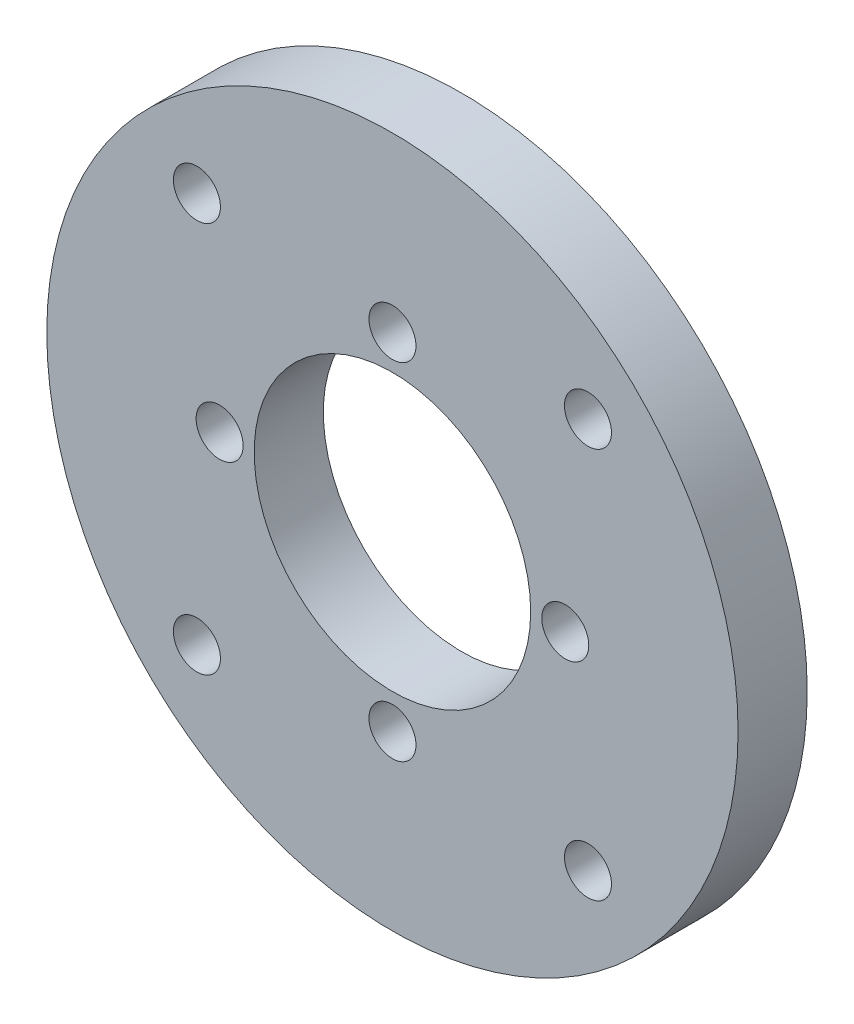
ISO-10303-21;
HEADER;
FILE_DESCRIPTION(('STEP AP214'),'2;1');
FILE_NAME('part.step','',(''),(''),'','','');
FILE_SCHEMA(('AUTOMOTIVE_DESIGN { 1 0 10303 214 1 1 1 1 }'));
ENDSEC;
DATA;
#1=APPLICATION_CONTEXT('core data for automotive mechanical design processes');
#2=APPLICATION_PROTOCOL_DEFINITION('international standard','automotive_design',2000,#1);
#3=PRODUCT_CONTEXT('',#1,'mechanical');
#4=PRODUCT('Part','Part','',(#3));
#5=PRODUCT_RELATED_PRODUCT_CATEGORY('part','',(#4));
#6=PRODUCT_DEFINITION_FORMATION('','',#4);
#7=PRODUCT_DEFINITION_CONTEXT('part definition',#1,'design');
#8=PRODUCT_DEFINITION('design','',#6,#7);
#9=PRODUCT_DEFINITION_SHAPE('','',#8);
#10=(LENGTH_UNIT() NAMED_UNIT(*) SI_UNIT(.MILLI.,.METRE.));
#11=(NAMED_UNIT(*) PLANE_ANGLE_UNIT() SI_UNIT($,.RADIAN.));
#12=(NAMED_UNIT(*) SI_UNIT($,.STERADIAN.) SOLID_ANGLE_UNIT());
#13=UNCERTAINTY_MEASURE_WITH_UNIT(LENGTH_MEASURE(1.E-05),#10,'distance_accuracy_value','');
#14=(GEOMETRIC_REPRESENTATION_CONTEXT(3) GLOBAL_UNCERTAINTY_ASSIGNED_CONTEXT((#13)) GLOBAL_UNIT_ASSIGNED_CONTEXT((#10,
#11,#12)) REPRESENTATION_CONTEXT('',''));
#15=CARTESIAN_POINT('',(0.,0.,0.));
#16=DIRECTION('',(0.,0.,1.));
#17=DIRECTION('',(1.,0.,0.));
#18=AXIS2_PLACEMENT_3D('',#15,#16,#17);
#19=CARTESIAN_POINT('',(0.,0.,5.));
#20=DIRECTION('',(0.,0.,1.));
#21=DIRECTION('',(1.,0.,0.));
#22=AXIS2_PLACEMENT_3D('',#19,#20,#21);
#23=PLANE('',#22);
#24=CARTESIAN_POINT('',(14.1421356237311,-14.1421356237308,5.));
#25=DIRECTION('',(0.,0.,1.));
#26=DIRECTION('',(1.,0.,0.));
#27=AXIS2_PLACEMENT_3D('',#24,#25,#26);
#28=CIRCLE('',#27,1.69999999999999);
#29=CARTESIAN_POINT('',(15.8421356237311,-14.1421356237308,5.));
#30=VERTEX_POINT('',#29);
#31=EDGE_CURVE('E69',#30,#30,#28,.T.);
#32=ORIENTED_EDGE('',*,*,#31,.F.);
#33=EDGE_LOOP('',(#32));
#34=FACE_BOUND('',#33,.T.);
#35=CARTESIAN_POINT('',(-14.1421356237309,-14.142135623731,5.));
#36=DIRECTION('',(0.,0.,1.));
#37=DIRECTION('',(1.,0.,0.));
#38=AXIS2_PLACEMENT_3D('',#35,#36,#37);
#39=CIRCLE('',#38,1.69999999999999);
#40=CARTESIAN_POINT('',(-12.4421356237309,-14.142135623731,5.));
#41=VERTEX_POINT('',#40);
#42=EDGE_CURVE('E58',#41,#41,#39,.T.);
#43=ORIENTED_EDGE('',*,*,#42,.F.);
#44=EDGE_LOOP('',(#43));
#45=FACE_BOUND('',#44,.T.);
#46=CARTESIAN_POINT('',(-14.142135623731,14.1421356237309,5.));
#47=DIRECTION('',(0.,0.,1.));
#48=DIRECTION('',(1.,0.,0.));
#49=AXIS2_PLACEMENT_3D('',#46,#47,#48);
#50=CIRCLE('',#49,1.69999999999999);
#51=CARTESIAN_POINT('',(-12.442135623731,14.1421356237309,5.));
#52=VERTEX_POINT('',#51);
#53=EDGE_CURVE('E57',#52,#52,#50,.T.);
#54=ORIENTED_EDGE('',*,*,#53,.F.);
#55=EDGE_LOOP('',(#54));
#56=FACE_BOUND('',#55,.T.);
#57=CARTESIAN_POINT('',(14.1421356237309,14.142135623731,5.));
#58=DIRECTION('',(0.,0.,1.));
#59=DIRECTION('',(1.,0.,0.));
#60=AXIS2_PLACEMENT_3D('',#57,#58,#59);
#61=CIRCLE('',#60,1.69999999999999);
#62=CARTESIAN_POINT('',(15.8421356237309,14.142135623731,5.));
#63=VERTEX_POINT('',#62);
#64=EDGE_CURVE('E54',#63,#63,#61,.T.);
#65=ORIENTED_EDGE('',*,*,#64,.F.);
#66=EDGE_LOOP('',(#65));
#67=FACE_BOUND('',#66,.T.);
#68=CARTESIAN_POINT('',(12.5,1.30930550206618E-13,5.));
#69=DIRECTION('',(0.,0.,1.));
#70=DIRECTION('',(1.,0.,0.));
#71=AXIS2_PLACEMENT_3D('',#68,#69,#70);
#72=CIRCLE('',#71,1.7);
#73=CARTESIAN_POINT('',(14.2,1.30930550206618E-13,5.));
#74=VERTEX_POINT('',#73);
#75=EDGE_CURVE('E53',#74,#74,#72,.T.);
#76=ORIENTED_EDGE('',*,*,#75,.F.);
#77=EDGE_LOOP('',(#76));
#78=FACE_BOUND('',#77,.T.);
#79=CARTESIAN_POINT('',(0.,-12.5,5.));
#80=DIRECTION('',(0.,0.,1.));
#81=DIRECTION('',(1.,0.,0.));
#82=AXIS2_PLACEMENT_3D('',#79,#80,#81);
#83=CIRCLE('',#82,1.7);
#84=CARTESIAN_POINT('',(1.7,-12.5,5.));
#85=VERTEX_POINT('',#84);
#86=EDGE_CURVE('E81',#85,#85,#83,.T.);
#87=ORIENTED_EDGE('',*,*,#86,.F.);
#88=EDGE_LOOP('',(#87));
#89=FACE_BOUND('',#88,.T.);
#90=CARTESIAN_POINT('',(-12.5,0.,5.));
#91=DIRECTION('',(0.,0.,1.));
#92=DIRECTION('',(1.,0.,0.));
#93=AXIS2_PLACEMENT_3D('',#90,#91,#92);
#94=CIRCLE('',#93,1.7);
#95=CARTESIAN_POINT('',(-10.8,0.,5.));
#96=VERTEX_POINT('',#95);
#97=EDGE_CURVE('E87',#96,#96,#94,.T.);
#98=ORIENTED_EDGE('',*,*,#97,.F.);
#99=EDGE_LOOP('',(#98));
#100=FACE_BOUND('',#99,.T.);
#101=CARTESIAN_POINT('',(0.,12.5,5.));
#102=DIRECTION('',(0.,0.,1.));
#103=DIRECTION('',(1.,0.,0.));
#104=AXIS2_PLACEMENT_3D('',#101,#102,#103);
#105=CIRCLE('',#104,1.7);
#106=CARTESIAN_POINT('',(1.7,12.5,5.));
#107=VERTEX_POINT('',#106);
#108=EDGE_CURVE('E93',#107,#107,#105,.T.);
#109=ORIENTED_EDGE('',*,*,#108,.F.);
#110=EDGE_LOOP('',(#109));
#111=FACE_BOUND('',#110,.T.);
#112=CARTESIAN_POINT('',(0.,0.,5.));
#113=DIRECTION('',(0.,0.,1.));
#114=DIRECTION('',(1.,0.,0.));
#115=AXIS2_PLACEMENT_3D('',#112,#113,#114);
#116=CIRCLE('',#115,25.);
#117=CARTESIAN_POINT('',(25.,0.,5.));
#118=VERTEX_POINT('',#117);
#119=EDGE_CURVE('E10',#118,#118,#116,.T.);
#120=ORIENTED_EDGE('',*,*,#119,.T.);
#121=EDGE_LOOP('',(#120));
#122=FACE_BOUND('',#121,.T.);
#123=CARTESIAN_POINT('',(0.,0.,5.));
#124=DIRECTION('',(0.,0.,1.));
#125=DIRECTION('',(1.,0.,0.));
#126=AXIS2_PLACEMENT_3D('',#123,#124,#125);
#127=CIRCLE('',#126,10.);
#128=CARTESIAN_POINT('',(10.,0.,5.));
#129=VERTEX_POINT('',#128);
#130=EDGE_CURVE('E45',#129,#129,#127,.T.);
#131=ORIENTED_EDGE('',*,*,#130,.F.);
#132=EDGE_LOOP('',(#131));
#133=FACE_BOUND('',#132,.T.);
#134=ADVANCED_FACE('F32',(#34,#45,#56,#67,#78,#89,#100,#111,#122,#133),#23,.T.);
#135=CARTESIAN_POINT('',(0.,0.,0.));
#136=DIRECTION('',(0.,0.,1.));
#137=DIRECTION('',(1.,0.,0.));
#138=AXIS2_PLACEMENT_3D('',#135,#136,#137);
#139=PLANE('',#138);
#140=CARTESIAN_POINT('',(14.1421356237311,-14.1421356237308,0.));
#141=DIRECTION('',(0.,0.,1.));
#142=DIRECTION('',(1.,0.,0.));
#143=AXIS2_PLACEMENT_3D('',#140,#141,#142);
#144=CIRCLE('',#143,1.69999999999999);
#145=CARTESIAN_POINT('',(15.8421356237311,-14.1421356237308,0.));
#146=VERTEX_POINT('',#145);
#147=EDGE_CURVE('E36',#146,#146,#144,.T.);
#148=ORIENTED_EDGE('',*,*,#147,.T.);
#149=EDGE_LOOP('',(#148));
#150=FACE_BOUND('',#149,.T.);
#151=CARTESIAN_POINT('',(-14.1421356237309,-14.142135623731,0.));
#152=DIRECTION('',(0.,0.,1.));
#153=DIRECTION('',(1.,0.,0.));
#154=AXIS2_PLACEMENT_3D('',#151,#152,#153);
#155=CIRCLE('',#154,1.69999999999999);
#156=CARTESIAN_POINT('',(-12.4421356237309,-14.142135623731,0.));
#157=VERTEX_POINT('',#156);
#158=EDGE_CURVE('E55',#157,#157,#155,.T.);
#159=ORIENTED_EDGE('',*,*,#158,.T.);
#160=EDGE_LOOP('',(#159));
#161=FACE_BOUND('',#160,.T.);
#162=CARTESIAN_POINT('',(-14.142135623731,14.1421356237309,0.));
#163=DIRECTION('',(0.,0.,1.));
#164=DIRECTION('',(1.,0.,0.));
#165=AXIS2_PLACEMENT_3D('',#162,#163,#164);
#166=CIRCLE('',#165,1.69999999999999);
#167=CARTESIAN_POINT('',(-12.442135623731,14.1421356237309,0.));
#168=VERTEX_POINT('',#167);
#169=EDGE_CURVE('E62',#168,#168,#166,.T.);
#170=ORIENTED_EDGE('',*,*,#169,.T.);
#171=EDGE_LOOP('',(#170));
#172=FACE_BOUND('',#171,.T.);
#173=CARTESIAN_POINT('',(14.1421356237309,14.142135623731,0.));
#174=DIRECTION('',(0.,0.,1.));
#175=DIRECTION('',(1.,0.,0.));
#176=AXIS2_PLACEMENT_3D('',#173,#174,#175);
#177=CIRCLE('',#176,1.69999999999999);
#178=CARTESIAN_POINT('',(15.8421356237309,14.142135623731,0.));
#179=VERTEX_POINT('',#178);
#180=EDGE_CURVE('E51',#179,#179,#177,.T.);
#181=ORIENTED_EDGE('',*,*,#180,.T.);
#182=EDGE_LOOP('',(#181));
#183=FACE_BOUND('',#182,.T.);
#184=CARTESIAN_POINT('',(12.5,1.30930550206618E-13,0.));
#185=DIRECTION('',(0.,0.,1.));
#186=DIRECTION('',(1.,0.,0.));
#187=AXIS2_PLACEMENT_3D('',#184,#185,#186);
#188=CIRCLE('',#187,1.7);
#189=CARTESIAN_POINT('',(14.2,1.30930550206618E-13,0.));
#190=VERTEX_POINT('',#189);
#191=EDGE_CURVE('E78',#190,#190,#188,.T.);
#192=ORIENTED_EDGE('',*,*,#191,.T.);
#193=EDGE_LOOP('',(#192));
#194=FACE_BOUND('',#193,.T.);
#195=CARTESIAN_POINT('',(0.,-12.5,0.));
#196=DIRECTION('',(0.,0.,1.));
#197=DIRECTION('',(1.,0.,0.));
#198=AXIS2_PLACEMENT_3D('',#195,#196,#197);
#199=CIRCLE('',#198,1.7);
#200=CARTESIAN_POINT('',(1.7,-12.5,0.));
#201=VERTEX_POINT('',#200);
#202=EDGE_CURVE('E84',#201,#201,#199,.T.);
#203=ORIENTED_EDGE('',*,*,#202,.T.);
#204=EDGE_LOOP('',(#203));
#205=FACE_BOUND('',#204,.T.);
#206=CARTESIAN_POINT('',(-12.5,0.,0.));
#207=DIRECTION('',(0.,0.,1.));
#208=DIRECTION('',(1.,0.,0.));
#209=AXIS2_PLACEMENT_3D('',#206,#207,#208);
#210=CIRCLE('',#209,1.7);
#211=CARTESIAN_POINT('',(-10.8,0.,0.));
#212=VERTEX_POINT('',#211);
#213=EDGE_CURVE('E90',#212,#212,#210,.T.);
#214=ORIENTED_EDGE('',*,*,#213,.T.);
#215=EDGE_LOOP('',(#214));
#216=FACE_BOUND('',#215,.T.);
#217=CARTESIAN_POINT('',(0.,12.5,0.));
#218=DIRECTION('',(0.,0.,1.));
#219=DIRECTION('',(1.,0.,0.));
#220=AXIS2_PLACEMENT_3D('',#217,#218,#219);
#221=CIRCLE('',#220,1.7);
#222=CARTESIAN_POINT('',(1.7,12.5,0.));
#223=VERTEX_POINT('',#222);
#224=EDGE_CURVE('E96',#223,#223,#221,.T.);
#225=ORIENTED_EDGE('',*,*,#224,.T.);
#226=EDGE_LOOP('',(#225));
#227=FACE_BOUND('',#226,.T.);
#228=CARTESIAN_POINT('',(0.,0.,0.));
#229=DIRECTION('',(0.,0.,1.));
#230=DIRECTION('',(1.,0.,0.));
#231=AXIS2_PLACEMENT_3D('',#228,#229,#230);
#232=CIRCLE('',#231,25.);
#233=CARTESIAN_POINT('',(25.,0.,0.));
#234=VERTEX_POINT('',#233);
#235=EDGE_CURVE('E40',#234,#234,#232,.T.);
#236=ORIENTED_EDGE('',*,*,#235,.F.);
#237=EDGE_LOOP('',(#236));
#238=FACE_BOUND('',#237,.T.);
#239=CARTESIAN_POINT('',(0.,0.,0.));
#240=DIRECTION('',(0.,0.,1.));
#241=DIRECTION('',(1.,0.,0.));
#242=AXIS2_PLACEMENT_3D('',#239,#240,#241);
#243=CIRCLE('',#242,10.);
#244=CARTESIAN_POINT('',(10.,0.,0.));
#245=VERTEX_POINT('',#244);
#246=EDGE_CURVE('E48',#245,#245,#243,.T.);
#247=ORIENTED_EDGE('',*,*,#246,.T.);
#248=EDGE_LOOP('',(#247));
#249=FACE_BOUND('',#248,.T.);
#250=ADVANCED_FACE('F104',(#150,#161,#172,#183,#194,#205,#216,#227,#238,#249),#139,.F.);
#251=CARTESIAN_POINT('',(0.,0.,5.));
#252=DIRECTION('',(0.,0.,-1.));
#253=DIRECTION('',(-1.,0.,0.));
#254=AXIS2_PLACEMENT_3D('',#251,#252,#253);
#255=CYLINDRICAL_SURFACE('',#254,25.);
#256=ORIENTED_EDGE('',*,*,#119,.F.);
#257=EDGE_LOOP('',(#256));
#258=FACE_BOUND('',#257,.T.);
#259=ORIENTED_EDGE('',*,*,#235,.T.);
#260=EDGE_LOOP('',(#259));
#261=FACE_BOUND('',#260,.T.);
#262=ADVANCED_FACE('F34',(#258,#261),#255,.T.);
#263=CARTESIAN_POINT('',(0.,0.,5.));
#264=DIRECTION('',(0.,0.,-1.));
#265=DIRECTION('',(-1.,0.,0.));
#266=AXIS2_PLACEMENT_3D('',#263,#264,#265);
#267=CYLINDRICAL_SURFACE('',#266,10.);
#268=ORIENTED_EDGE('',*,*,#130,.T.);
#269=EDGE_LOOP('',(#268));
#270=FACE_BOUND('',#269,.T.);
#271=ORIENTED_EDGE('',*,*,#246,.F.);
#272=EDGE_LOOP('',(#271));
#273=FACE_BOUND('',#272,.T.);
#274=ADVANCED_FACE('F106',(#270,#273),#267,.F.);
#275=CARTESIAN_POINT('',(0.,12.5,5.));
#276=DIRECTION('',(0.,0.,1.));
#277=DIRECTION('',(1.,0.,0.));
#278=AXIS2_PLACEMENT_3D('',#275,#276,#277);
#279=CYLINDRICAL_SURFACE('',#278,1.7);
#280=ORIENTED_EDGE('',*,*,#108,.T.);
#281=EDGE_LOOP('',(#280));
#282=FACE_BOUND('',#281,.T.);
#283=ORIENTED_EDGE('',*,*,#224,.F.);
#284=EDGE_LOOP('',(#283));
#285=FACE_BOUND('',#284,.T.);
#286=ADVANCED_FACE('F108',(#282,#285),#279,.F.);
#287=CARTESIAN_POINT('',(-12.5,0.,5.));
#288=DIRECTION('',(0.,0.,1.));
#289=DIRECTION('',(1.,0.,0.));
#290=AXIS2_PLACEMENT_3D('',#287,#288,#289);
#291=CYLINDRICAL_SURFACE('',#290,1.7);
#292=ORIENTED_EDGE('',*,*,#97,.T.);
#293=EDGE_LOOP('',(#292));
#294=FACE_BOUND('',#293,.T.);
#295=ORIENTED_EDGE('',*,*,#213,.F.);
#296=EDGE_LOOP('',(#295));
#297=FACE_BOUND('',#296,.T.);
#298=ADVANCED_FACE('F114',(#294,#297),#291,.F.);
#299=CARTESIAN_POINT('',(0.,-12.5,5.));
#300=DIRECTION('',(0.,0.,1.));
#301=DIRECTION('',(1.,0.,0.));
#302=AXIS2_PLACEMENT_3D('',#299,#300,#301);
#303=CYLINDRICAL_SURFACE('',#302,1.7);
#304=ORIENTED_EDGE('',*,*,#86,.T.);
#305=EDGE_LOOP('',(#304));
#306=FACE_BOUND('',#305,.T.);
#307=ORIENTED_EDGE('',*,*,#202,.F.);
#308=EDGE_LOOP('',(#307));
#309=FACE_BOUND('',#308,.T.);
#310=ADVANCED_FACE('F150',(#306,#309),#303,.F.);
#311=CARTESIAN_POINT('',(12.5,1.30930550206618E-13,5.));
#312=DIRECTION('',(0.,0.,1.));
#313=DIRECTION('',(1.,0.,0.));
#314=AXIS2_PLACEMENT_3D('',#311,#312,#313);
#315=CYLINDRICAL_SURFACE('',#314,1.7);
#316=ORIENTED_EDGE('',*,*,#75,.T.);
#317=EDGE_LOOP('',(#316));
#318=FACE_BOUND('',#317,.T.);
#319=ORIENTED_EDGE('',*,*,#191,.F.);
#320=EDGE_LOOP('',(#319));
#321=FACE_BOUND('',#320,.T.);
#322=ADVANCED_FACE('F157',(#318,#321),#315,.F.);
#323=CARTESIAN_POINT('',(14.1421356237309,14.142135623731,5.));
#324=DIRECTION('',(0.,0.,1.));
#325=DIRECTION('',(1.,0.,0.));
#326=AXIS2_PLACEMENT_3D('',#323,#324,#325);
#327=CYLINDRICAL_SURFACE('',#326,1.69999999999999);
#328=ORIENTED_EDGE('',*,*,#64,.T.);
#329=EDGE_LOOP('',(#328));
#330=FACE_BOUND('',#329,.T.);
#331=ORIENTED_EDGE('',*,*,#180,.F.);
#332=EDGE_LOOP('',(#331));
#333=FACE_BOUND('',#332,.T.);
#334=ADVANCED_FACE('F163',(#330,#333),#327,.F.);
#335=CARTESIAN_POINT('',(-14.142135623731,14.1421356237309,5.));
#336=DIRECTION('',(0.,0.,1.));
#337=DIRECTION('',(1.,0.,0.));
#338=AXIS2_PLACEMENT_3D('',#335,#336,#337);
#339=CYLINDRICAL_SURFACE('',#338,1.69999999999999);
#340=ORIENTED_EDGE('',*,*,#53,.T.);
#341=EDGE_LOOP('',(#340));
#342=FACE_BOUND('',#341,.T.);
#343=ORIENTED_EDGE('',*,*,#169,.F.);
#344=EDGE_LOOP('',(#343));
#345=FACE_BOUND('',#344,.T.);
#346=ADVANCED_FACE('F167',(#342,#345),#339,.F.);
#347=CARTESIAN_POINT('',(-14.1421356237309,-14.142135623731,5.));
#348=DIRECTION('',(0.,0.,1.));
#349=DIRECTION('',(1.,0.,0.));
#350=AXIS2_PLACEMENT_3D('',#347,#348,#349);
#351=CYLINDRICAL_SURFACE('',#350,1.69999999999999);
#352=ORIENTED_EDGE('',*,*,#42,.T.);
#353=EDGE_LOOP('',(#352));
#354=FACE_BOUND('',#353,.T.);
#355=ORIENTED_EDGE('',*,*,#158,.F.);
#356=EDGE_LOOP('',(#355));
#357=FACE_BOUND('',#356,.T.);
#358=ADVANCED_FACE('F171',(#354,#357),#351,.F.);
#359=CARTESIAN_POINT('',(14.1421356237311,-14.1421356237308,5.));
#360=DIRECTION('',(0.,0.,1.));
#361=DIRECTION('',(1.,0.,0.));
#362=AXIS2_PLACEMENT_3D('',#359,#360,#361);
#363=CYLINDRICAL_SURFACE('',#362,1.69999999999999);
#364=ORIENTED_EDGE('',*,*,#31,.T.);
#365=EDGE_LOOP('',(#364));
#366=FACE_BOUND('',#365,.T.);
#367=ORIENTED_EDGE('',*,*,#147,.F.);
#368=EDGE_LOOP('',(#367));
#369=FACE_BOUND('',#368,.T.);
#370=ADVANCED_FACE('F175',(#366,#369),#363,.F.);
#371=CLOSED_SHELL('',(#134,#250,#262,#274,#286,#298,#310,#322,#334,#346,#358,#370));
#372=MANIFOLD_SOLID_BREP('B2',#371);
#373=ADVANCED_BREP_SHAPE_REPRESENTATION('',(#18,#372),#14);
#374=SHAPE_DEFINITION_REPRESENTATION(#9,#373);
ENDSEC;
END-ISO-10303-21;
